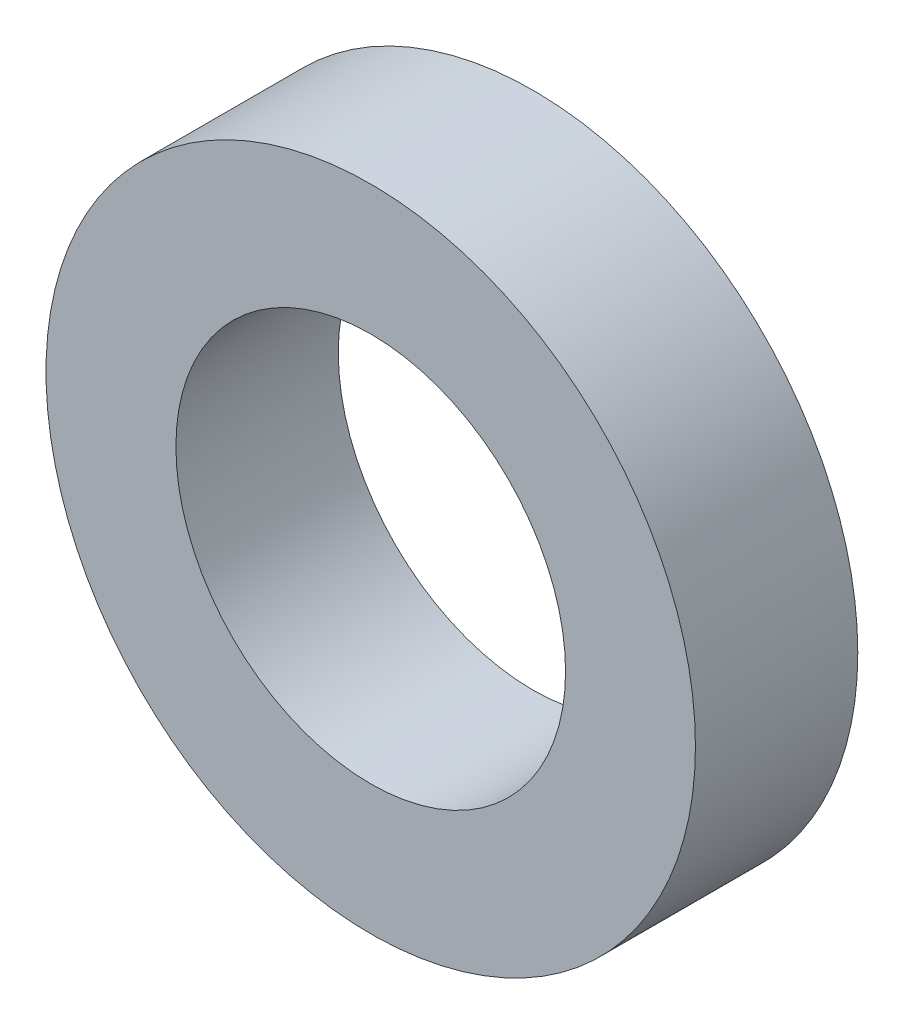
ISO-10303-21;
HEADER;
FILE_DESCRIPTION(('STEP AP214'),'2;1');
FILE_NAME('part.step','',(''),(''),'','','');
FILE_SCHEMA(('AUTOMOTIVE_DESIGN { 1 0 10303 214 1 1 1 1 }'));
ENDSEC;
DATA;
#1=APPLICATION_CONTEXT('core data for automotive mechanical design processes');
#2=APPLICATION_PROTOCOL_DEFINITION('international standard','automotive_design',2000,#1);
#3=PRODUCT_CONTEXT('',#1,'mechanical');
#4=PRODUCT('Part','Part','',(#3));
#5=PRODUCT_RELATED_PRODUCT_CATEGORY('part','',(#4));
#6=PRODUCT_DEFINITION_FORMATION('','',#4);
#7=PRODUCT_DEFINITION_CONTEXT('part definition',#1,'design');
#8=PRODUCT_DEFINITION('design','',#6,#7);
#9=PRODUCT_DEFINITION_SHAPE('','',#8);
#10=(LENGTH_UNIT() NAMED_UNIT(*) SI_UNIT(.MILLI.,.METRE.));
#11=(NAMED_UNIT(*) PLANE_ANGLE_UNIT() SI_UNIT($,.RADIAN.));
#12=(NAMED_UNIT(*) SI_UNIT($,.STERADIAN.) SOLID_ANGLE_UNIT());
#13=UNCERTAINTY_MEASURE_WITH_UNIT(LENGTH_MEASURE(1.E-05),#10,'distance_accuracy_value','');
#14=(GEOMETRIC_REPRESENTATION_CONTEXT(3) GLOBAL_UNCERTAINTY_ASSIGNED_CONTEXT((#13)) GLOBAL_UNIT_ASSIGNED_CONTEXT((#10,
#11,#12)) REPRESENTATION_CONTEXT('',''));
#15=CARTESIAN_POINT('',(0.,0.,0.));
#16=DIRECTION('',(0.,0.,1.));
#17=DIRECTION('',(1.,0.,0.));
#18=AXIS2_PLACEMENT_3D('',#15,#16,#17);
#19=CARTESIAN_POINT('',(0.,0.,2.5));
#20=DIRECTION('',(0.,0.,1.));
#21=DIRECTION('',(1.,0.,0.));
#22=AXIS2_PLACEMENT_3D('',#19,#20,#21);
#23=PLANE('',#22);
#24=CARTESIAN_POINT('',(0.,0.,2.5));
#25=DIRECTION('',(0.,0.,1.));
#26=DIRECTION('',(1.,0.,0.));
#27=AXIS2_PLACEMENT_3D('',#24,#25,#26);
#28=CIRCLE('',#27,5.);
#29=CARTESIAN_POINT('',(5.,0.,2.5));
#30=VERTEX_POINT('',#29);
#31=EDGE_CURVE('E10',#30,#30,#28,.T.);
#32=ORIENTED_EDGE('',*,*,#31,.T.);
#33=EDGE_LOOP('',(#32));
#34=FACE_BOUND('',#33,.T.);
#35=CARTESIAN_POINT('',(0.,0.,2.5));
#36=DIRECTION('',(0.,0.,1.));
#37=DIRECTION('',(1.,0.,0.));
#38=AXIS2_PLACEMENT_3D('',#35,#36,#37);
#39=CIRCLE('',#38,3.);
#40=CARTESIAN_POINT('',(3.,0.,2.5));
#41=VERTEX_POINT('',#40);
#42=EDGE_CURVE('E42',#41,#41,#39,.T.);
#43=ORIENTED_EDGE('',*,*,#42,.F.);
#44=EDGE_LOOP('',(#43));
#45=FACE_BOUND('',#44,.T.);
#46=ADVANCED_FACE('F31',(#34,#45),#23,.T.);
#47=CARTESIAN_POINT('',(0.,0.,0.));
#48=DIRECTION('',(0.,0.,1.));
#49=DIRECTION('',(1.,0.,0.));
#50=AXIS2_PLACEMENT_3D('',#47,#48,#49);
#51=PLANE('',#50);
#52=CARTESIAN_POINT('',(0.,0.,0.));
#53=DIRECTION('',(0.,0.,1.));
#54=DIRECTION('',(1.,0.,0.));
#55=AXIS2_PLACEMENT_3D('',#52,#53,#54);
#56=CIRCLE('',#55,5.);
#57=CARTESIAN_POINT('',(5.,0.,0.));
#58=VERTEX_POINT('',#57);
#59=EDGE_CURVE('E35',#58,#58,#56,.T.);
#60=ORIENTED_EDGE('',*,*,#59,.F.);
#61=EDGE_LOOP('',(#60));
#62=FACE_BOUND('',#61,.T.);
#63=CARTESIAN_POINT('',(0.,0.,0.));
#64=DIRECTION('',(0.,0.,1.));
#65=DIRECTION('',(1.,0.,0.));
#66=AXIS2_PLACEMENT_3D('',#63,#64,#65);
#67=CIRCLE('',#66,3.);
#68=CARTESIAN_POINT('',(3.,0.,0.));
#69=VERTEX_POINT('',#68);
#70=EDGE_CURVE('E44',#69,#69,#67,.T.);
#71=ORIENTED_EDGE('',*,*,#70,.T.);
#72=EDGE_LOOP('',(#71));
#73=FACE_BOUND('',#72,.T.);
#74=ADVANCED_FACE('F54',(#62,#73),#51,.F.);
#75=CARTESIAN_POINT('',(0.,0.,2.5));
#76=DIRECTION('',(0.,0.,-1.));
#77=DIRECTION('',(-1.,0.,0.));
#78=AXIS2_PLACEMENT_3D('',#75,#76,#77);
#79=CYLINDRICAL_SURFACE('',#78,5.);
#80=ORIENTED_EDGE('',*,*,#31,.F.);
#81=EDGE_LOOP('',(#80));
#82=FACE_BOUND('',#81,.T.);
#83=ORIENTED_EDGE('',*,*,#59,.T.);
#84=EDGE_LOOP('',(#83));
#85=FACE_BOUND('',#84,.T.);
#86=ADVANCED_FACE('F33',(#82,#85),#79,.T.);
#87=CARTESIAN_POINT('',(0.,0.,2.5));
#88=DIRECTION('',(0.,0.,-1.));
#89=DIRECTION('',(-1.,0.,0.));
#90=AXIS2_PLACEMENT_3D('',#87,#88,#89);
#91=CYLINDRICAL_SURFACE('',#90,3.);
#92=ORIENTED_EDGE('',*,*,#42,.T.);
#93=EDGE_LOOP('',(#92));
#94=FACE_BOUND('',#93,.T.);
#95=ORIENTED_EDGE('',*,*,#70,.F.);
#96=EDGE_LOOP('',(#95));
#97=FACE_BOUND('',#96,.T.);
#98=ADVANCED_FACE('F50',(#94,#97),#91,.F.);
#99=CLOSED_SHELL('',(#46,#74,#86,#98));
#100=MANIFOLD_SOLID_BREP('B2',#99);
#101=ADVANCED_BREP_SHAPE_REPRESENTATION('',(#18,#100),#14);
#102=SHAPE_DEFINITION_REPRESENTATION(#9,#101);
ENDSEC;
END-ISO-10303-21;
